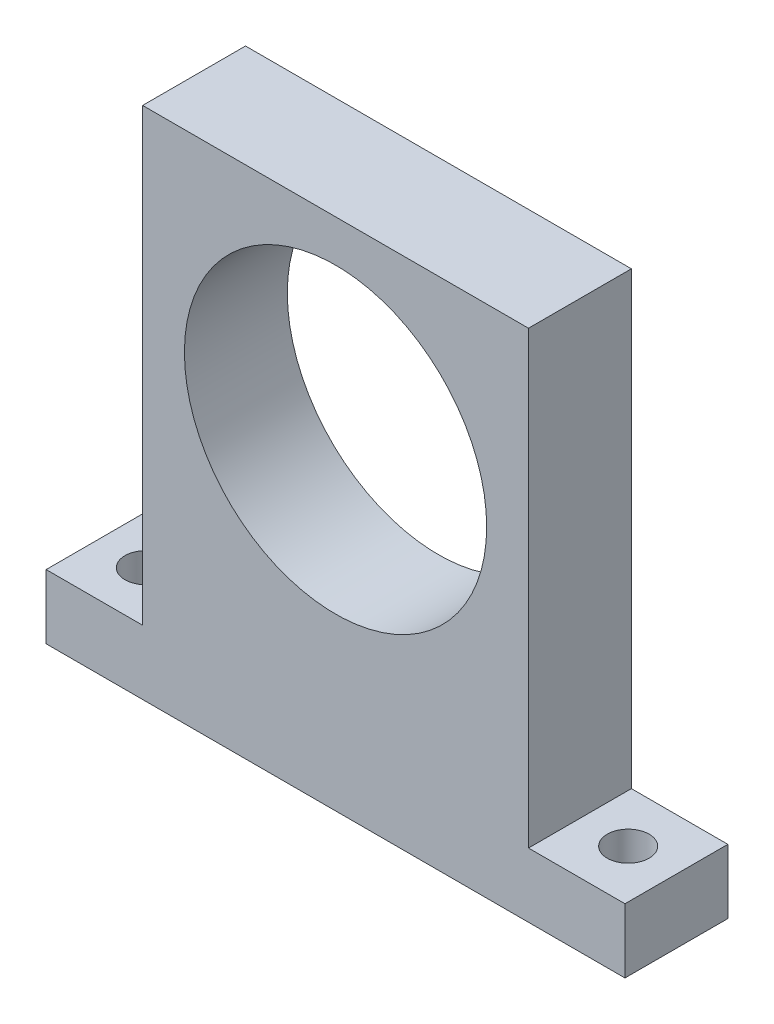
ISO-10303-21;
HEADER;
FILE_DESCRIPTION(('STEP AP214'),'2;1');
FILE_NAME('part.step','',(''),(''),'','','');
FILE_SCHEMA(('AUTOMOTIVE_DESIGN { 1 0 10303 214 1 1 1 1 }'));
ENDSEC;
DATA;
#1=APPLICATION_CONTEXT('core data for automotive mechanical design processes');
#2=APPLICATION_PROTOCOL_DEFINITION('international standard','automotive_design',2000,#1);
#3=PRODUCT_CONTEXT('',#1,'mechanical');
#4=PRODUCT('Part','Part','',(#3));
#5=PRODUCT_RELATED_PRODUCT_CATEGORY('part','',(#4));
#6=PRODUCT_DEFINITION_FORMATION('','',#4);
#7=PRODUCT_DEFINITION_CONTEXT('part definition',#1,'design');
#8=PRODUCT_DEFINITION('design','',#6,#7);
#9=PRODUCT_DEFINITION_SHAPE('','',#8);
#10=(LENGTH_UNIT() NAMED_UNIT(*) SI_UNIT(.MILLI.,.METRE.));
#11=(NAMED_UNIT(*) PLANE_ANGLE_UNIT() SI_UNIT($,.RADIAN.));
#12=(NAMED_UNIT(*) SI_UNIT($,.STERADIAN.) SOLID_ANGLE_UNIT());
#13=UNCERTAINTY_MEASURE_WITH_UNIT(LENGTH_MEASURE(1.E-05),#10,'distance_accuracy_value','');
#14=(GEOMETRIC_REPRESENTATION_CONTEXT(3) GLOBAL_UNCERTAINTY_ASSIGNED_CONTEXT((#13)) GLOBAL_UNIT_ASSIGNED_CONTEXT((#10,
#11,#12)) REPRESENTATION_CONTEXT('',''));
#15=CARTESIAN_POINT('',(0.,0.,0.));
#16=DIRECTION('',(0.,0.,1.));
#17=DIRECTION('',(1.,0.,0.));
#18=AXIS2_PLACEMENT_3D('',#15,#16,#17);
#19=CARTESIAN_POINT('',(-30.,-40.,8.));
#20=DIRECTION('',(1.,0.,0.));
#21=DIRECTION('',(0.,0.,-1.));
#22=AXIS2_PLACEMENT_3D('',#19,#20,#21);
#23=PLANE('',#22);
#24=DIRECTION('',(0.,0.,-1.));
#25=VECTOR('',#24,1.);
#26=CARTESIAN_POINT('',(-30.,-30.,8.));
#27=LINE('',#26,#25);
#28=CARTESIAN_POINT('',(-30.,-30.,8.));
#29=VERTEX_POINT('',#28);
#30=CARTESIAN_POINT('',(-30.,-30.,-8.));
#31=VERTEX_POINT('',#30);
#32=EDGE_CURVE('E48',#29,#31,#27,.T.);
#33=ORIENTED_EDGE('',*,*,#32,.F.);
#34=DIRECTION('',(0.,-1.,0.));
#35=VECTOR('',#34,1.);
#36=CARTESIAN_POINT('',(-30.,-40.,8.));
#37=LINE('',#36,#35);
#38=CARTESIAN_POINT('',(-30.,40.,8.));
#39=VERTEX_POINT('',#38);
#40=EDGE_CURVE('E123',#39,#29,#37,.T.);
#41=ORIENTED_EDGE('',*,*,#40,.F.);
#42=DIRECTION('',(0.,0.,-1.));
#43=VECTOR('',#42,1.);
#44=CARTESIAN_POINT('',(-30.,40.,8.));
#45=LINE('',#44,#43);
#46=CARTESIAN_POINT('',(-30.,40.,-8.));
#47=VERTEX_POINT('',#46);
#48=EDGE_CURVE('E41',#39,#47,#45,.T.);
#49=ORIENTED_EDGE('',*,*,#48,.T.);
#50=DIRECTION('',(0.,-1.,0.));
#51=VECTOR('',#50,1.);
#52=CARTESIAN_POINT('',(-30.,-40.,-8.));
#53=LINE('',#52,#51);
#54=EDGE_CURVE('E174',#47,#31,#53,.T.);
#55=ORIENTED_EDGE('',*,*,#54,.T.);
#56=EDGE_LOOP('',(#33,#41,#49,#55));
#57=FACE_BOUND('',#56,.T.);
#58=ADVANCED_FACE('F33',(#57),#23,.F.);
#59=CARTESIAN_POINT('',(0.,0.,8.));
#60=DIRECTION('',(0.,0.,-1.));
#61=DIRECTION('',(-1.,0.,0.));
#62=AXIS2_PLACEMENT_3D('',#59,#60,#61);
#63=PLANE('',#62);
#64=DIRECTION('',(1.,0.,0.));
#65=VECTOR('',#64,1.);
#66=CARTESIAN_POINT('',(-30.,-40.,8.));
#67=LINE('',#66,#65);
#68=CARTESIAN_POINT('',(-45.,-40.,8.));
#69=VERTEX_POINT('',#68);
#70=CARTESIAN_POINT('',(45.,-40.,8.));
#71=VERTEX_POINT('',#70);
#72=EDGE_CURVE('E169',#69,#71,#67,.T.);
#73=ORIENTED_EDGE('',*,*,#72,.T.);
#74=DIRECTION('',(0.,-1.,0.));
#75=VECTOR('',#74,1.);
#76=CARTESIAN_POINT('',(45.,-30.,8.));
#77=LINE('',#76,#75);
#78=CARTESIAN_POINT('',(45.,-30.,8.));
#79=VERTEX_POINT('',#78);
#80=EDGE_CURVE('E151',#79,#71,#77,.T.);
#81=ORIENTED_EDGE('',*,*,#80,.F.);
#82=DIRECTION('',(-1.,0.,0.));
#83=VECTOR('',#82,1.);
#84=CARTESIAN_POINT('',(30.,-30.,8.));
#85=LINE('',#84,#83);
#86=CARTESIAN_POINT('',(30.,-30.,8.));
#87=VERTEX_POINT('',#86);
#88=EDGE_CURVE('E145',#79,#87,#85,.T.);
#89=ORIENTED_EDGE('',*,*,#88,.T.);
#90=DIRECTION('',(0.,1.,0.));
#91=VECTOR('',#90,1.);
#92=CARTESIAN_POINT('',(30.,-40.,8.));
#93=LINE('',#92,#91);
#94=CARTESIAN_POINT('',(30.,40.,8.));
#95=VERTEX_POINT('',#94);
#96=EDGE_CURVE('E163',#87,#95,#93,.T.);
#97=ORIENTED_EDGE('',*,*,#96,.T.);
#98=DIRECTION('',(-1.,0.,0.));
#99=VECTOR('',#98,1.);
#100=CARTESIAN_POINT('',(-30.,40.,8.));
#101=LINE('',#100,#99);
#102=EDGE_CURVE('E165',#95,#39,#101,.T.);
#103=ORIENTED_EDGE('',*,*,#102,.T.);
#104=ORIENTED_EDGE('',*,*,#40,.T.);
#105=DIRECTION('',(1.,0.,0.));
#106=VECTOR('',#105,1.);
#107=CARTESIAN_POINT('',(-30.,-30.,8.));
#108=LINE('',#107,#106);
#109=CARTESIAN_POINT('',(-45.,-30.,8.));
#110=VERTEX_POINT('',#109);
#111=EDGE_CURVE('E105',#110,#29,#108,.T.);
#112=ORIENTED_EDGE('',*,*,#111,.F.);
#113=DIRECTION('',(0.,-1.,0.));
#114=VECTOR('',#113,1.);
#115=CARTESIAN_POINT('',(-45.,-30.,8.));
#116=LINE('',#115,#114);
#117=EDGE_CURVE('E114',#110,#69,#116,.T.);
#118=ORIENTED_EDGE('',*,*,#117,.T.);
#119=EDGE_LOOP('',(#73,#81,#89,#97,#103,#104,#112,#118));
#120=FACE_BOUND('',#119,.T.);
#121=CARTESIAN_POINT('',(0.,10.,8.));
#122=DIRECTION('',(0.,0.,1.));
#123=DIRECTION('',(1.,0.,0.));
#124=AXIS2_PLACEMENT_3D('',#121,#122,#123);
#125=CIRCLE('',#124,23.5);
#126=CARTESIAN_POINT('',(23.5,10.,8.));
#127=VERTEX_POINT('',#126);
#128=EDGE_CURVE('E157',#127,#127,#125,.T.);
#129=ORIENTED_EDGE('',*,*,#128,.F.);
#130=EDGE_LOOP('',(#129));
#131=FACE_BOUND('',#130,.T.);
#132=ADVANCED_FACE('F121',(#120,#131),#63,.F.);
#133=CARTESIAN_POINT('',(0.,0.,-8.));
#134=DIRECTION('',(0.,0.,-1.));
#135=DIRECTION('',(-1.,0.,0.));
#136=AXIS2_PLACEMENT_3D('',#133,#134,#135);
#137=PLANE('',#136);
#138=DIRECTION('',(0.,1.,0.));
#139=VECTOR('',#138,1.);
#140=CARTESIAN_POINT('',(30.,-40.,-8.));
#141=LINE('',#140,#139);
#142=CARTESIAN_POINT('',(30.,-30.,-8.));
#143=VERTEX_POINT('',#142);
#144=CARTESIAN_POINT('',(30.,40.,-8.));
#145=VERTEX_POINT('',#144);
#146=EDGE_CURVE('E160',#143,#145,#141,.T.);
#147=ORIENTED_EDGE('',*,*,#146,.F.);
#148=DIRECTION('',(1.,0.,0.));
#149=VECTOR('',#148,1.);
#150=CARTESIAN_POINT('',(30.,-30.,-8.));
#151=LINE('',#150,#149);
#152=CARTESIAN_POINT('',(45.,-30.,-8.));
#153=VERTEX_POINT('',#152);
#154=EDGE_CURVE('E56',#143,#153,#151,.T.);
#155=ORIENTED_EDGE('',*,*,#154,.T.);
#156=DIRECTION('',(0.,-1.,0.));
#157=VECTOR('',#156,1.);
#158=CARTESIAN_POINT('',(45.,-30.,-8.));
#159=LINE('',#158,#157);
#160=CARTESIAN_POINT('',(45.,-40.,-8.));
#161=VERTEX_POINT('',#160);
#162=EDGE_CURVE('E148',#153,#161,#159,.T.);
#163=ORIENTED_EDGE('',*,*,#162,.T.);
#164=DIRECTION('',(1.,0.,0.));
#165=VECTOR('',#164,1.);
#166=CARTESIAN_POINT('',(-30.,-40.,-8.));
#167=LINE('',#166,#165);
#168=CARTESIAN_POINT('',(-45.,-40.,-8.));
#169=VERTEX_POINT('',#168);
#170=EDGE_CURVE('E166',#169,#161,#167,.T.);
#171=ORIENTED_EDGE('',*,*,#170,.F.);
#172=DIRECTION('',(0.,-1.,0.));
#173=VECTOR('',#172,1.);
#174=CARTESIAN_POINT('',(-45.,-30.,-8.));
#175=LINE('',#174,#173);
#176=CARTESIAN_POINT('',(-45.,-30.,-8.));
#177=VERTEX_POINT('',#176);
#178=EDGE_CURVE('E119',#177,#169,#175,.T.);
#179=ORIENTED_EDGE('',*,*,#178,.F.);
#180=DIRECTION('',(-1.,0.,0.));
#181=VECTOR('',#180,1.);
#182=CARTESIAN_POINT('',(-30.,-30.,-8.));
#183=LINE('',#182,#181);
#184=EDGE_CURVE('E107',#31,#177,#183,.T.);
#185=ORIENTED_EDGE('',*,*,#184,.F.);
#186=ORIENTED_EDGE('',*,*,#54,.F.);
#187=DIRECTION('',(-1.,0.,0.));
#188=VECTOR('',#187,1.);
#189=CARTESIAN_POINT('',(-30.,40.,-8.));
#190=LINE('',#189,#188);
#191=EDGE_CURVE('E172',#145,#47,#190,.T.);
#192=ORIENTED_EDGE('',*,*,#191,.F.);
#193=EDGE_LOOP('',(#147,#155,#163,#171,#179,#185,#186,#192));
#194=FACE_BOUND('',#193,.T.);
#195=CARTESIAN_POINT('',(0.,10.,-8.));
#196=DIRECTION('',(0.,0.,1.));
#197=DIRECTION('',(1.,0.,0.));
#198=AXIS2_PLACEMENT_3D('',#195,#196,#197);
#199=CIRCLE('',#198,23.5);
#200=CARTESIAN_POINT('',(23.5,10.,-8.));
#201=VERTEX_POINT('',#200);
#202=EDGE_CURVE('E154',#201,#201,#199,.T.);
#203=ORIENTED_EDGE('',*,*,#202,.T.);
#204=EDGE_LOOP('',(#203));
#205=FACE_BOUND('',#204,.T.);
#206=ADVANCED_FACE('F184',(#194,#205),#137,.T.);
#207=CARTESIAN_POINT('',(30.,-40.,8.));
#208=DIRECTION('',(-1.,0.,0.));
#209=DIRECTION('',(0.,0.,1.));
#210=AXIS2_PLACEMENT_3D('',#207,#208,#209);
#211=PLANE('',#210);
#212=ORIENTED_EDGE('',*,*,#96,.F.);
#213=DIRECTION('',(0.,0.,-1.));
#214=VECTOR('',#213,1.);
#215=CARTESIAN_POINT('',(30.,-30.,8.));
#216=LINE('',#215,#214);
#217=EDGE_CURVE('E139',#87,#143,#216,.T.);
#218=ORIENTED_EDGE('',*,*,#217,.T.);
#219=ORIENTED_EDGE('',*,*,#146,.T.);
#220=DIRECTION('',(0.,0.,-1.));
#221=VECTOR('',#220,1.);
#222=CARTESIAN_POINT('',(30.,40.,8.));
#223=LINE('',#222,#221);
#224=EDGE_CURVE('E11',#95,#145,#223,.T.);
#225=ORIENTED_EDGE('',*,*,#224,.F.);
#226=EDGE_LOOP('',(#212,#218,#219,#225));
#227=FACE_BOUND('',#226,.T.);
#228=ADVANCED_FACE('F35',(#227),#211,.F.);
#229=CARTESIAN_POINT('',(-30.,40.,8.));
#230=DIRECTION('',(0.,-1.,0.));
#231=DIRECTION('',(0.,0.,-1.));
#232=AXIS2_PLACEMENT_3D('',#229,#230,#231);
#233=PLANE('',#232);
#234=ORIENTED_EDGE('',*,*,#191,.T.);
#235=ORIENTED_EDGE('',*,*,#48,.F.);
#236=ORIENTED_EDGE('',*,*,#102,.F.);
#237=ORIENTED_EDGE('',*,*,#224,.T.);
#238=EDGE_LOOP('',(#234,#235,#236,#237));
#239=FACE_BOUND('',#238,.T.);
#240=ADVANCED_FACE('F197',(#239),#233,.F.);
#241=CARTESIAN_POINT('',(-30.,-40.,8.));
#242=DIRECTION('',(0.,1.,0.));
#243=DIRECTION('',(0.,0.,1.));
#244=AXIS2_PLACEMENT_3D('',#241,#242,#243);
#245=PLANE('',#244);
#246=ORIENTED_EDGE('',*,*,#170,.T.);
#247=DIRECTION('',(0.,0.,1.));
#248=VECTOR('',#247,1.);
#249=CARTESIAN_POINT('',(45.,-40.,8.));
#250=LINE('',#249,#248);
#251=EDGE_CURVE('E136',#161,#71,#250,.T.);
#252=ORIENTED_EDGE('',*,*,#251,.T.);
#253=ORIENTED_EDGE('',*,*,#72,.F.);
#254=DIRECTION('',(0.,0.,1.));
#255=VECTOR('',#254,1.);
#256=CARTESIAN_POINT('',(-45.,-40.,8.));
#257=LINE('',#256,#255);
#258=EDGE_CURVE('E117',#169,#69,#257,.T.);
#259=ORIENTED_EDGE('',*,*,#258,.F.);
#260=EDGE_LOOP('',(#246,#252,#253,#259));
#261=FACE_BOUND('',#260,.T.);
#262=CARTESIAN_POINT('',(37.5,-40.,0.));
#263=DIRECTION('',(0.,-1.,0.));
#264=DIRECTION('',(0.,0.,-1.));
#265=AXIS2_PLACEMENT_3D('',#262,#263,#264);
#266=CIRCLE('',#265,3.25);
#267=CARTESIAN_POINT('',(37.5,-40.,-3.25));
#268=VERTEX_POINT('',#267);
#269=EDGE_CURVE('E131',#268,#268,#266,.T.);
#270=ORIENTED_EDGE('',*,*,#269,.F.);
#271=EDGE_LOOP('',(#270));
#272=FACE_BOUND('',#271,.T.);
#273=CARTESIAN_POINT('',(-37.5,-40.,0.));
#274=DIRECTION('',(0.,1.,0.));
#275=DIRECTION('',(0.,0.,-1.));
#276=AXIS2_PLACEMENT_3D('',#273,#274,#275);
#277=CIRCLE('',#276,3.25);
#278=CARTESIAN_POINT('',(-37.5,-40.,-3.25));
#279=VERTEX_POINT('',#278);
#280=EDGE_CURVE('E240',#279,#279,#277,.T.);
#281=ORIENTED_EDGE('',*,*,#280,.T.);
#282=EDGE_LOOP('',(#281));
#283=FACE_BOUND('',#282,.T.);
#284=ADVANCED_FACE('F187',(#261,#272,#283),#245,.F.);
#285=CARTESIAN_POINT('',(0.,10.,8.));
#286=DIRECTION('',(0.,0.,-1.));
#287=DIRECTION('',(-1.,0.,0.));
#288=AXIS2_PLACEMENT_3D('',#285,#286,#287);
#289=CYLINDRICAL_SURFACE('',#288,23.5);
#290=ORIENTED_EDGE('',*,*,#128,.T.);
#291=EDGE_LOOP('',(#290));
#292=FACE_BOUND('',#291,.T.);
#293=ORIENTED_EDGE('',*,*,#202,.F.);
#294=EDGE_LOOP('',(#293));
#295=FACE_BOUND('',#294,.T.);
#296=ADVANCED_FACE('F203',(#292,#295),#289,.F.);
#297=CARTESIAN_POINT('',(45.,-30.,8.));
#298=DIRECTION('',(1.,0.,0.));
#299=DIRECTION('',(0.,0.,-1.));
#300=AXIS2_PLACEMENT_3D('',#297,#298,#299);
#301=PLANE('',#300);
#302=ORIENTED_EDGE('',*,*,#251,.F.);
#303=ORIENTED_EDGE('',*,*,#162,.F.);
#304=DIRECTION('',(0.,0.,1.));
#305=VECTOR('',#304,1.);
#306=CARTESIAN_POINT('',(45.,-30.,8.));
#307=LINE('',#306,#305);
#308=EDGE_CURVE('E142',#153,#79,#307,.T.);
#309=ORIENTED_EDGE('',*,*,#308,.T.);
#310=ORIENTED_EDGE('',*,*,#80,.T.);
#311=EDGE_LOOP('',(#302,#303,#309,#310));
#312=FACE_BOUND('',#311,.T.);
#313=ADVANCED_FACE('F191',(#312),#301,.T.);
#314=CARTESIAN_POINT('',(0.,-30.,0.));
#315=DIRECTION('',(0.,-1.,0.));
#316=DIRECTION('',(0.,0.,-1.));
#317=AXIS2_PLACEMENT_3D('',#314,#315,#316);
#318=PLANE('',#317);
#319=CARTESIAN_POINT('',(37.5,-30.,0.));
#320=DIRECTION('',(0.,-1.,0.));
#321=DIRECTION('',(0.,0.,-1.));
#322=AXIS2_PLACEMENT_3D('',#319,#320,#321);
#323=CIRCLE('',#322,3.25);
#324=CARTESIAN_POINT('',(37.5,-30.,-3.25));
#325=VERTEX_POINT('',#324);
#326=EDGE_CURVE('E133',#325,#325,#323,.T.);
#327=ORIENTED_EDGE('',*,*,#326,.T.);
#328=EDGE_LOOP('',(#327));
#329=FACE_BOUND('',#328,.T.);
#330=ORIENTED_EDGE('',*,*,#217,.F.);
#331=ORIENTED_EDGE('',*,*,#88,.F.);
#332=ORIENTED_EDGE('',*,*,#308,.F.);
#333=ORIENTED_EDGE('',*,*,#154,.F.);
#334=EDGE_LOOP('',(#330,#331,#332,#333));
#335=FACE_BOUND('',#334,.T.);
#336=ADVANCED_FACE('F193',(#329,#335),#318,.F.);
#337=CARTESIAN_POINT('',(37.5,-30.,0.));
#338=DIRECTION('',(0.,-1.,0.));
#339=DIRECTION('',(0.,0.,-1.));
#340=AXIS2_PLACEMENT_3D('',#337,#338,#339);
#341=CYLINDRICAL_SURFACE('',#340,3.25);
#342=ORIENTED_EDGE('',*,*,#326,.F.);
#343=EDGE_LOOP('',(#342));
#344=FACE_BOUND('',#343,.T.);
#345=ORIENTED_EDGE('',*,*,#269,.T.);
#346=EDGE_LOOP('',(#345));
#347=FACE_BOUND('',#346,.T.);
#348=ADVANCED_FACE('F221',(#344,#347),#341,.F.);
#349=CARTESIAN_POINT('',(0.,-30.,0.));
#350=DIRECTION('',(0.,-1.,0.));
#351=DIRECTION('',(0.,0.,-1.));
#352=AXIS2_PLACEMENT_3D('',#349,#350,#351);
#353=PLANE('',#352);
#354=ORIENTED_EDGE('',*,*,#32,.T.);
#355=ORIENTED_EDGE('',*,*,#184,.T.);
#356=DIRECTION('',(0.,0.,1.));
#357=VECTOR('',#356,1.);
#358=CARTESIAN_POINT('',(-45.,-30.,8.));
#359=LINE('',#358,#357);
#360=EDGE_CURVE('E100',#177,#110,#359,.T.);
#361=ORIENTED_EDGE('',*,*,#360,.T.);
#362=ORIENTED_EDGE('',*,*,#111,.T.);
#363=EDGE_LOOP('',(#354,#355,#361,#362));
#364=FACE_BOUND('',#363,.T.);
#365=CARTESIAN_POINT('',(-37.5,-30.,0.));
#366=DIRECTION('',(0.,1.,0.));
#367=DIRECTION('',(0.,0.,-1.));
#368=AXIS2_PLACEMENT_3D('',#365,#366,#367);
#369=CIRCLE('',#368,3.25);
#370=CARTESIAN_POINT('',(-37.5,-30.,-3.25));
#371=VERTEX_POINT('',#370);
#372=EDGE_CURVE('E130',#371,#371,#369,.T.);
#373=ORIENTED_EDGE('',*,*,#372,.F.);
#374=EDGE_LOOP('',(#373));
#375=FACE_BOUND('',#374,.T.);
#376=ADVANCED_FACE('F102',(#364,#375),#353,.F.);
#377=CARTESIAN_POINT('',(-45.,-30.,8.));
#378=DIRECTION('',(1.,0.,0.));
#379=DIRECTION('',(0.,0.,-1.));
#380=AXIS2_PLACEMENT_3D('',#377,#378,#379);
#381=PLANE('',#380);
#382=ORIENTED_EDGE('',*,*,#258,.T.);
#383=ORIENTED_EDGE('',*,*,#117,.F.);
#384=ORIENTED_EDGE('',*,*,#360,.F.);
#385=ORIENTED_EDGE('',*,*,#178,.T.);
#386=EDGE_LOOP('',(#382,#383,#384,#385));
#387=FACE_BOUND('',#386,.T.);
#388=ADVANCED_FACE('F115',(#387),#381,.F.);
#389=CARTESIAN_POINT('',(-37.5,-30.,0.));
#390=DIRECTION('',(0.,-1.,0.));
#391=DIRECTION('',(0.,0.,-1.));
#392=AXIS2_PLACEMENT_3D('',#389,#390,#391);
#393=CYLINDRICAL_SURFACE('',#392,3.25);
#394=ORIENTED_EDGE('',*,*,#372,.T.);
#395=EDGE_LOOP('',(#394));
#396=FACE_BOUND('',#395,.T.);
#397=ORIENTED_EDGE('',*,*,#280,.F.);
#398=EDGE_LOOP('',(#397));
#399=FACE_BOUND('',#398,.T.);
#400=ADVANCED_FACE('F228',(#396,#399),#393,.F.);
#401=CLOSED_SHELL('',(#58,#132,#206,#228,#240,#284,#296,#313,#336,#348,#376,#388,#400));
#402=MANIFOLD_SOLID_BREP('B2',#401);
#403=ADVANCED_BREP_SHAPE_REPRESENTATION('',(#18,#402),#14);
#404=SHAPE_DEFINITION_REPRESENTATION(#9,#403);
ENDSEC;
END-ISO-10303-21;
